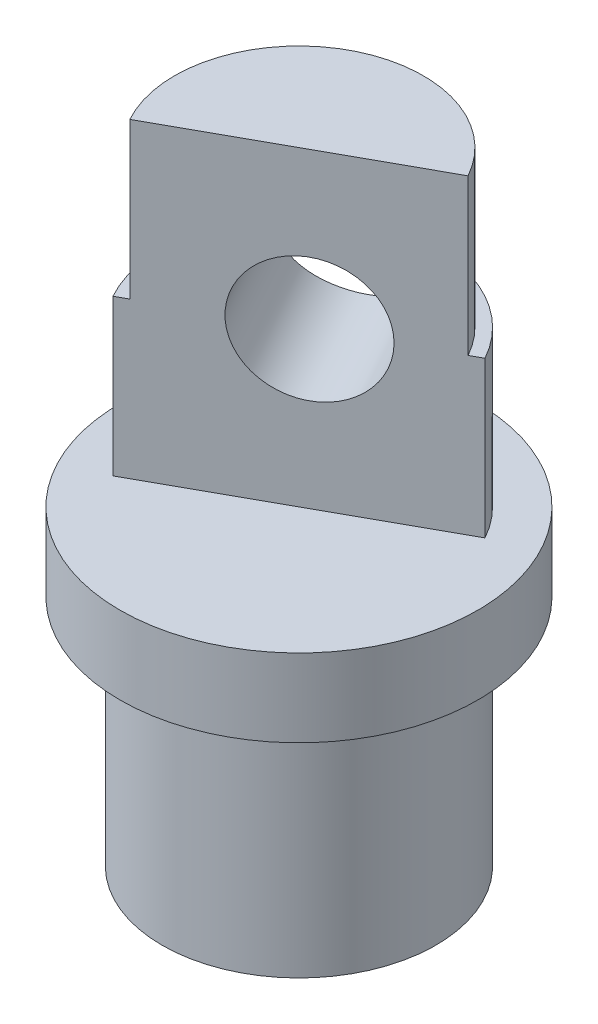
ISO-10303-21;
HEADER;
FILE_DESCRIPTION(('STEP AP214'),'2;1');
FILE_NAME('part.step','',(''),(''),'','','');
FILE_SCHEMA(('AUTOMOTIVE_DESIGN { 1 0 10303 214 1 1 1 1 }'));
ENDSEC;
DATA;
#1=APPLICATION_CONTEXT('core data for automotive mechanical design processes');
#2=APPLICATION_PROTOCOL_DEFINITION('international standard','automotive_design',2000,#1);
#3=PRODUCT_CONTEXT('',#1,'mechanical');
#4=PRODUCT('Part','Part','',(#3));
#5=PRODUCT_RELATED_PRODUCT_CATEGORY('part','',(#4));
#6=PRODUCT_DEFINITION_FORMATION('','',#4);
#7=PRODUCT_DEFINITION_CONTEXT('part definition',#1,'design');
#8=PRODUCT_DEFINITION('design','',#6,#7);
#9=PRODUCT_DEFINITION_SHAPE('','',#8);
#10=(LENGTH_UNIT() NAMED_UNIT(*) SI_UNIT(.MILLI.,.METRE.));
#11=(NAMED_UNIT(*) PLANE_ANGLE_UNIT() SI_UNIT($,.RADIAN.));
#12=(NAMED_UNIT(*) SI_UNIT($,.STERADIAN.) SOLID_ANGLE_UNIT());
#13=UNCERTAINTY_MEASURE_WITH_UNIT(LENGTH_MEASURE(1.E-05),#10,'distance_accuracy_value','');
#14=(GEOMETRIC_REPRESENTATION_CONTEXT(3) GLOBAL_UNCERTAINTY_ASSIGNED_CONTEXT((#13)) GLOBAL_UNIT_ASSIGNED_CONTEXT((#10,
#11,#12)) REPRESENTATION_CONTEXT('',''));
#15=CARTESIAN_POINT('',(0.,0.,0.));
#16=DIRECTION('',(0.,0.,1.));
#17=DIRECTION('',(1.,0.,0.));
#18=AXIS2_PLACEMENT_3D('',#15,#16,#17);
#19=CARTESIAN_POINT('',(0.,10.,0.));
#20=DIRECTION('',(0.,1.,0.));
#21=DIRECTION('',(0.,0.,1.));
#22=AXIS2_PLACEMENT_3D('',#19,#20,#21);
#23=PLANE('',#22);
#24=DIRECTION('',(0.482982259159725,0.,0.875630137293691));
#25=VECTOR('',#24,1.);
#26=CARTESIAN_POINT('',(-12.7243506637224,10.,-15.8221648388148));
#27=LINE('',#26,#25);
#28=CARTESIAN_POINT('',(-6.96431991364859,10.,-5.37942823545009));
#29=VERTEX_POINT('',#28);
#30=CARTESIAN_POINT('',(-6.53915779604642,10.,-4.60862401573455));
#31=VERTEX_POINT('',#30);
#32=EDGE_CURVE('E57',#29,#31,#27,.T.);
#33=ORIENTED_EDGE('',*,*,#32,.F.);
#34=CARTESIAN_POINT('',(0.,10.,0.));
#35=DIRECTION('',(0.,1.,0.));
#36=DIRECTION('',(0.,0.,1.));
#37=AXIS2_PLACEMENT_3D('',#34,#35,#36);
#38=CIRCLE('',#37,8.8);
#39=CARTESIAN_POINT('',(-7.70554520818448,10.,4.25024388060558));
#40=VERTEX_POINT('',#39);
#41=EDGE_CURVE('E64',#29,#40,#38,.T.);
#42=ORIENTED_EDGE('',*,*,#41,.T.);
#43=DIRECTION('',(-0.875630137293691,0.,0.482982259159725));
#44=VECTOR('',#43,1.);
#45=CARTESIAN_POINT('',(0.,10.,0.));
#46=LINE('',#45,#44);
#47=CARTESIAN_POINT('',(-7.00504109834953,10.,3.8638580732778));
#48=VERTEX_POINT('',#47);
#49=EDGE_CURVE('E129',#48,#40,#46,.T.);
#50=ORIENTED_EDGE('',*,*,#49,.F.);
#51=CARTESIAN_POINT('',(0.,10.,0.));
#52=DIRECTION('',(0.,1.,0.));
#53=DIRECTION('',(0.,0.,1.));
#54=AXIS2_PLACEMENT_3D('',#51,#52,#53);
#55=CIRCLE('',#54,8.);
#56=EDGE_CURVE('E120',#31,#48,#55,.T.);
#57=ORIENTED_EDGE('',*,*,#56,.F.);
#58=EDGE_LOOP('',(#33,#42,#50,#57));
#59=FACE_BOUND('',#58,.T.);
#60=ADVANCED_FACE('F35',(#59),#23,.T.);
#61=CARTESIAN_POINT('',(0.,10.,0.));
#62=DIRECTION('',(0.,-1.,0.));
#63=DIRECTION('',(0.,0.,-1.));
#64=AXIS2_PLACEMENT_3D('',#61,#62,#63);
#65=CYLINDRICAL_SURFACE('',#64,8.8);
#66=ORIENTED_EDGE('',*,*,#41,.F.);
#67=CARTESIAN_POINT('',(-6.96431991364859,10.,-5.37942823545009));
#68=CARTESIAN_POINT('',(-6.96432220289091,9.89210141958878,-5.37939929286805));
#69=CARTESIAN_POINT('',(-6.96141125486834,9.78421542854017,-5.38319325296465));
#70=CARTESIAN_POINT('',(-6.94978516830629,9.56931793282347,-5.39820804820861));
#71=CARTESIAN_POINT('',(-6.94107234337719,9.46230609678091,-5.40942592291577));
#72=CARTESIAN_POINT('',(-6.91791095127872,9.2503416928685,-5.43901093228729));
#73=CARTESIAN_POINT('',(-6.90348535642285,9.14538262296445,-5.45734942766403));
#74=CARTESIAN_POINT('',(-6.86894338621582,8.93784460777494,-5.5007620219522));
#75=CARTESIAN_POINT('',(-6.84882663585899,8.83526581981483,-5.52583656471456));
#76=CARTESIAN_POINT('',(-6.7800407087772,8.53236546186448,-5.61038103347538));
#77=CARTESIAN_POINT('',(-6.72288864384484,8.33644438682403,-5.67923550682383));
#78=CARTESIAN_POINT('',(-6.58627574413191,7.96118347706894,-5.83710693250562));
#79=CARTESIAN_POINT('',(-6.50679249003665,7.78186054777457,-5.92614412976562));
#80=CARTESIAN_POINT('',(-6.32100121200402,7.43465333851041,-6.12407382821569));
#81=CARTESIAN_POINT('',(-6.21351319905917,7.26784879592225,-6.23375806215649));
#82=CARTESIAN_POINT('',(-5.97442216281694,6.96051039071593,-6.46325857982505));
#83=CARTESIAN_POINT('',(-5.84281582483202,6.81998014445962,-6.58307625501586));
#84=CARTESIAN_POINT('',(-5.55231354350498,6.56538901360295,-6.83001630074398));
#85=CARTESIAN_POINT('',(-5.39274914151732,6.45219247878584,-6.95724947391196));
#86=CARTESIAN_POINT('',(-5.05148638067405,6.26165097800602,-7.20883483079804));
#87=CARTESIAN_POINT('',(-4.86980092234881,6.18428524155603,-7.33318864381032));
#88=CARTESIAN_POINT('',(-4.50083011390963,6.07225016941568,-7.56484741382379));
#89=CARTESIAN_POINT('',(-4.3146420036924,6.03517122900056,-7.67273393060156));
#90=CARTESIAN_POINT('',(-3.93192656901403,5.99651515684422,-7.87570994053218));
#91=CARTESIAN_POINT('',(-3.73540245203132,5.99492707594749,-7.97080337143408));
#92=CARTESIAN_POINT('',(-3.34904295499333,6.02597729779011,-8.14039652838706));
#93=CARTESIAN_POINT('',(-3.1594198666421,6.05677102499544,-8.2157313195642));
#94=CARTESIAN_POINT('',(-2.78194420993391,6.14814011708001,-8.35110884136956));
#95=CARTESIAN_POINT('',(-2.59409186880132,6.2087192524324,-8.41114963450109));
#96=CARTESIAN_POINT('',(-2.21847748853823,6.3600162079023,-8.51809213903458));
#97=CARTESIAN_POINT('',(-2.03096934497434,6.45175400409948,-8.56443386167103));
#98=CARTESIAN_POINT('',(-1.66818937084018,6.66182764931983,-8.64243176957126));
#99=CARTESIAN_POINT('',(-1.49292316714504,6.78017562534602,-8.67408123894737));
#100=CARTESIAN_POINT('',(-1.14349204802809,7.05292872389901,-8.72734296773273));
#101=CARTESIAN_POINT('',(-0.970966941324082,7.20967245661666,-8.74773788663034));
#102=CARTESIAN_POINT('',(-0.65149141205273,7.54869820873635,-8.77731928698406));
#103=CARTESIAN_POINT('',(-0.504561154393288,7.73100016194585,-8.78649696487438));
#104=CARTESIAN_POINT('',(-0.305680111343894,8.02454369510717,-8.79495412210706));
#105=CARTESIAN_POINT('',(-0.24198337661191,8.12791114346352,-8.79686999787534));
#106=CARTESIAN_POINT('',(-0.124174338627409,8.33996535139417,-8.79932074146859));
#107=CARTESIAN_POINT('',(-0.0700572667574645,8.44864942984181,-8.79985629820696));
#108=CARTESIAN_POINT('',(0.027571005021353,8.67042378208687,-8.80009242022067));
#109=CARTESIAN_POINT('',(0.0711037704673443,8.78350454264089,-8.79979469906223));
#110=CARTESIAN_POINT('',(0.14681611760782,9.01334976203387,-8.79885612823984));
#111=CARTESIAN_POINT('',(0.179001992347749,9.13011213975631,-8.79821546926913));
#112=CARTESIAN_POINT('',(0.232426570444255,9.37149042811306,-8.79697512100519));
#113=CARTESIAN_POINT('',(0.253126223489621,9.49622669556753,-8.79637843986787));
#114=CARTESIAN_POINT('',(0.280865537360464,9.74729628891789,-8.79551891583877));
#115=CARTESIAN_POINT('',(0.287895184386923,9.87363071739512,-8.79525631772414));
#116=CARTESIAN_POINT('',(0.287827188577564,10.,-8.79529166710892));
#117=B_SPLINE_CURVE_WITH_KNOTS('',3,(#67,#68,#69,#70,#71,#72,#73,#74,#75,#76,#77,#78,#79,#80,
#81,#82,#83,#84,#85,#86,#87,#88,#89,#90,#91,#92,#93,#94,#95,#96,#97,#98,#99,#100,#101,#102,#103,
#104,#105,#106,#107,#108,#109,#110,#111,#112,#113,#114,#115,#116),.UNSPECIFIED.,.F.,.F.,(4,2,2,
2,2,2,2,2,2,2,2,2,2,2,2,2,2,2,2,2,2,2,2,2,4),(0.,0.323568868536418,0.647008784949489,
0.969161073704104,1.29133459489305,1.93437029438007,2.57805388830937,3.25520985095699,
3.93245894801599,4.62892764324753,5.32499210086223,5.97663731976011,6.6280814991944,
7.24432891446323,7.8606543593083,8.49949055811039,9.13861848464775,9.83759192386127,
10.537113583044,10.9009944919438,11.2646937536915,11.6276456482034,11.9903959298336,
12.3689771446847,12.7478355803526),.UNSPECIFIED.);
#118=CARTESIAN_POINT('',(0.287827188577566,10.,-8.79529166710891));
#119=VERTEX_POINT('',#118);
#120=EDGE_CURVE('E155',#29,#119,#117,.T.);
#121=ORIENTED_EDGE('',*,*,#120,.T.);
#122=CARTESIAN_POINT('',(7.70554520818448,10.,-4.25024388060556));
#123=VERTEX_POINT('',#122);
#124=EDGE_CURVE('E112',#123,#119,#38,.T.);
#125=ORIENTED_EDGE('',*,*,#124,.F.);
#126=DIRECTION('',(0.,-1.,0.));
#127=VECTOR('',#126,1.);
#128=CARTESIAN_POINT('',(7.70554520818448,10.,-4.25024388060556));
#129=LINE('',#128,#127);
#130=CARTESIAN_POINT('',(7.70554520818448,0.,-4.25024388060556));
#131=VERTEX_POINT('',#130);
#132=EDGE_CURVE('E137',#123,#131,#129,.T.);
#133=ORIENTED_EDGE('',*,*,#132,.T.);
#134=CARTESIAN_POINT('',(0.,0.,0.));
#135=DIRECTION('',(0.,1.,0.));
#136=DIRECTION('',(0.,0.,1.));
#137=AXIS2_PLACEMENT_3D('',#134,#135,#136);
#138=CIRCLE('',#137,8.8);
#139=CARTESIAN_POINT('',(-7.70554520818448,0.,4.25024388060558));
#140=VERTEX_POINT('',#139);
#141=EDGE_CURVE('E123',#131,#140,#138,.T.);
#142=ORIENTED_EDGE('',*,*,#141,.T.);
#143=DIRECTION('',(0.,-1.,0.));
#144=VECTOR('',#143,1.);
#145=CARTESIAN_POINT('',(-7.70554520818448,10.,4.25024388060558));
#146=LINE('',#145,#144);
#147=EDGE_CURVE('E132',#40,#140,#146,.T.);
#148=ORIENTED_EDGE('',*,*,#147,.F.);
#149=EDGE_LOOP('',(#66,#121,#125,#133,#142,#148));
#150=FACE_BOUND('',#149,.T.);
#151=ADVANCED_FACE('F37',(#150),#65,.T.);
#152=CARTESIAN_POINT('',(0.,10.,0.));
#153=DIRECTION('',(0.482982259159725,0.,0.875630137293691));
#154=DIRECTION('',(0.875630137293691,0.,-0.482982259159725));
#155=AXIS2_PLACEMENT_3D('',#152,#153,#154);
#156=PLANE('',#155);
#157=CARTESIAN_POINT('',(0.437815068646844,10.,-0.241491129579862));
#158=DIRECTION('',(0.482982259159725,0.,0.875630137293691));
#159=DIRECTION('',(0.875630137293691,0.,-0.482982259159725));
#160=AXIS2_PLACEMENT_3D('',#157,#158,#159);
#161=CIRCLE('',#160,4.);
#162=CARTESIAN_POINT('',(3.94033561782161,10.,-2.17342016621876));
#163=VERTEX_POINT('',#162);
#164=EDGE_CURVE('E113',#163,#163,#161,.T.);
#165=ORIENTED_EDGE('',*,*,#164,.F.);
#166=EDGE_LOOP('',(#165));
#167=FACE_BOUND('',#166,.T.);
#168=ORIENTED_EDGE('',*,*,#147,.T.);
#169=DIRECTION('',(0.875630137293692,0.,-0.482982259159723));
#170=VECTOR('',#169,1.);
#171=CARTESIAN_POINT('',(0.,0.,0.));
#172=LINE('',#171,#170);
#173=EDGE_CURVE('E75',#140,#131,#172,.T.);
#174=ORIENTED_EDGE('',*,*,#173,.T.);
#175=ORIENTED_EDGE('',*,*,#132,.F.);
#176=DIRECTION('',(0.875630137293692,0.,-0.482982259159723));
#177=VECTOR('',#176,1.);
#178=CARTESIAN_POINT('',(0.,10.,0.));
#179=LINE('',#178,#177);
#180=CARTESIAN_POINT('',(7.00504109834953,10.,-3.8638580732778));
#181=VERTEX_POINT('',#180);
#182=EDGE_CURVE('E119',#181,#123,#179,.T.);
#183=ORIENTED_EDGE('',*,*,#182,.F.);
#184=DIRECTION('',(0.,-1.,0.));
#185=VECTOR('',#184,1.);
#186=CARTESIAN_POINT('',(7.00504109834953,20.,-3.8638580732778));
#187=LINE('',#186,#185);
#188=CARTESIAN_POINT('',(7.00504109834953,20.,-3.8638580732778));
#189=VERTEX_POINT('',#188);
#190=EDGE_CURVE('E117',#189,#181,#187,.T.);
#191=ORIENTED_EDGE('',*,*,#190,.F.);
#192=DIRECTION('',(0.875630137293691,0.,-0.482982259159725));
#193=VECTOR('',#192,1.);
#194=CARTESIAN_POINT('',(0.,20.,0.));
#195=LINE('',#194,#193);
#196=CARTESIAN_POINT('',(-7.00504109834953,20.,3.8638580732778));
#197=VERTEX_POINT('',#196);
#198=EDGE_CURVE('E142',#197,#189,#195,.T.);
#199=ORIENTED_EDGE('',*,*,#198,.F.);
#200=DIRECTION('',(0.,-1.,0.));
#201=VECTOR('',#200,1.);
#202=CARTESIAN_POINT('',(-7.00504109834953,20.,3.8638580732778));
#203=LINE('',#202,#201);
#204=EDGE_CURVE('E160',#197,#48,#203,.T.);
#205=ORIENTED_EDGE('',*,*,#204,.T.);
#206=ORIENTED_EDGE('',*,*,#49,.T.);
#207=EDGE_LOOP('',(#168,#174,#175,#183,#191,#199,#205,#206));
#208=FACE_BOUND('',#207,.T.);
#209=ADVANCED_FACE('F188',(#167,#208),#156,.T.);
#210=DIRECTION('',(0.482982259159725,0.,0.875630137293691));
#211=VECTOR('',#210,1.);
#212=CARTESIAN_POINT('',(-5.71930956537289,10.,-19.6860229120926));
#213=LINE('',#212,#211);
#214=CARTESIAN_POINT('',(0.745708254339659,10.,-7.96516912559989));
#215=VERTEX_POINT('',#214);
#216=EDGE_CURVE('E101',#215,#119,#213,.F.);
#217=ORIENTED_EDGE('',*,*,#216,.F.);
#218=EDGE_CURVE('E110',#181,#215,#55,.T.);
#219=ORIENTED_EDGE('',*,*,#218,.F.);
#220=ORIENTED_EDGE('',*,*,#182,.T.);
#221=ORIENTED_EDGE('',*,*,#124,.T.);
#222=EDGE_LOOP('',(#217,#219,#220,#221));
#223=FACE_BOUND('',#222,.T.);
#224=ADVANCED_FACE('F109',(#223),#23,.T.);
#225=CARTESIAN_POINT('',(0.,0.,0.));
#226=DIRECTION('',(0.,1.,0.));
#227=DIRECTION('',(0.,0.,1.));
#228=AXIS2_PLACEMENT_3D('',#225,#226,#227);
#229=PLANE('',#228);
#230=ORIENTED_EDGE('',*,*,#141,.F.);
#231=ORIENTED_EDGE('',*,*,#173,.F.);
#232=EDGE_LOOP('',(#230,#231));
#233=FACE_BOUND('',#232,.T.);
#234=CARTESIAN_POINT('',(0.,0.,0.));
#235=DIRECTION('',(0.,1.,0.));
#236=DIRECTION('',(0.,0.,1.));
#237=AXIS2_PLACEMENT_3D('',#234,#235,#236);
#238=CIRCLE('',#237,11.5);
#239=CARTESIAN_POINT('',(0.,0.,11.5));
#240=VERTEX_POINT('',#239);
#241=EDGE_CURVE('E125',#240,#240,#238,.T.);
#242=ORIENTED_EDGE('',*,*,#241,.T.);
#243=EDGE_LOOP('',(#242));
#244=FACE_BOUND('',#243,.T.);
#245=ADVANCED_FACE('F170',(#233,#244),#229,.T.);
#246=CARTESIAN_POINT('',(0.,-5.,0.));
#247=DIRECTION('',(0.,1.,0.));
#248=DIRECTION('',(0.,0.,1.));
#249=AXIS2_PLACEMENT_3D('',#246,#247,#248);
#250=CYLINDRICAL_SURFACE('',#249,11.5);
#251=CARTESIAN_POINT('',(0.,-5.,0.));
#252=DIRECTION('',(0.,1.,0.));
#253=DIRECTION('',(0.,0.,1.));
#254=AXIS2_PLACEMENT_3D('',#251,#252,#253);
#255=CIRCLE('',#254,11.5);
#256=CARTESIAN_POINT('',(0.,-5.,11.5));
#257=VERTEX_POINT('',#256);
#258=EDGE_CURVE('E135',#257,#257,#255,.T.);
#259=ORIENTED_EDGE('',*,*,#258,.T.);
#260=EDGE_LOOP('',(#259));
#261=FACE_BOUND('',#260,.T.);
#262=ORIENTED_EDGE('',*,*,#241,.F.);
#263=EDGE_LOOP('',(#262));
#264=FACE_BOUND('',#263,.T.);
#265=ADVANCED_FACE('F172',(#261,#264),#250,.T.);
#266=CARTESIAN_POINT('',(0.,-5.,0.));
#267=DIRECTION('',(0.,1.,0.));
#268=DIRECTION('',(0.,0.,1.));
#269=AXIS2_PLACEMENT_3D('',#266,#267,#268);
#270=PLANE('',#269);
#271=CARTESIAN_POINT('',(0.,-5.,0.));
#272=DIRECTION('',(0.,1.,0.));
#273=DIRECTION('',(0.,0.,1.));
#274=AXIS2_PLACEMENT_3D('',#271,#272,#273);
#275=CIRCLE('',#274,8.8);
#276=CARTESIAN_POINT('',(0.,-5.,8.8));
#277=VERTEX_POINT('',#276);
#278=EDGE_CURVE('E140',#277,#277,#275,.T.);
#279=ORIENTED_EDGE('',*,*,#278,.T.);
#280=EDGE_LOOP('',(#279));
#281=FACE_BOUND('',#280,.T.);
#282=ORIENTED_EDGE('',*,*,#258,.F.);
#283=EDGE_LOOP('',(#282));
#284=FACE_BOUND('',#283,.T.);
#285=ADVANCED_FACE('F174',(#281,#284),#270,.F.);
#286=CARTESIAN_POINT('',(0.,20.,0.));
#287=DIRECTION('',(0.,-1.,0.));
#288=DIRECTION('',(0.,0.,-1.));
#289=AXIS2_PLACEMENT_3D('',#286,#287,#288);
#290=CYLINDRICAL_SURFACE('',#289,8.);
#291=ORIENTED_EDGE('',*,*,#218,.T.);
#292=CARTESIAN_POINT('',(0.745708254339659,10.,-7.96516912559989));
#293=CARTESIAN_POINT('',(0.745743344645021,10.1022117724854,-7.96514874804964));
#294=CARTESIAN_POINT('',(0.740991602238525,10.2044031472943,-7.96561038014839));
#295=CARTESIAN_POINT('',(0.722185937965853,10.4078424855474,-7.96734638795599));
#296=CARTESIAN_POINT('',(0.708139233642986,10.5090911192205,-7.96862013303067));
#297=CARTESIAN_POINT('',(0.671143293148901,10.7092060550943,-7.97181838094412));
#298=CARTESIAN_POINT('',(0.648256570336927,10.8080840198916,-7.97373830226345));
#299=CARTESIAN_POINT('',(0.59405348537022,11.0034777716488,-7.97795959328334));
#300=CARTESIAN_POINT('',(0.562735845496108,11.0999931981414,-7.98026102078147));
#301=CARTESIAN_POINT('',(0.457142901403037,11.3845263163609,-7.98724050181386));
#302=CARTESIAN_POINT('',(0.371083158791604,11.5682795537561,-7.99201016065774));
#303=CARTESIAN_POINT('',(0.172223737692132,11.92091293406,-7.99876272436184));
#304=CARTESIAN_POINT('',(0.0593733693469037,12.0897640399714,-8.00074029649921));
#305=CARTESIAN_POINT('',(-0.201183821778084,12.426605278999,-7.99863621663031));
#306=CARTESIAN_POINT('',(-0.351273076838058,12.5927473731547,-7.99391531004346));
#307=CARTESIAN_POINT('',(-0.673292692183616,12.9017121440945,-7.97324677188734));
#308=CARTESIAN_POINT('',(-0.845230770753492,13.0445265392246,-7.95729516389074));
#309=CARTESIAN_POINT('',(-1.12539507065749,13.2460551870438,-7.92109051804056));
#310=CARTESIAN_POINT('',(-1.22785144216259,13.3138777087752,-7.90592566182195));
#311=CARTESIAN_POINT('',(-1.43709510329481,13.4409681867408,-7.87057775070424));
#312=CARTESIAN_POINT('',(-1.54388066070834,13.5002395220728,-7.85039668664768));
#313=CARTESIAN_POINT('',(-1.7609174220276,13.6096791982581,-7.80458046559721));
#314=CARTESIAN_POINT('',(-1.87116917501227,13.6598460882675,-7.77894444073672));
#315=CARTESIAN_POINT('',(-2.09409286242507,13.7504548929144,-7.7219167284521));
#316=CARTESIAN_POINT('',(-2.20676336529581,13.790902396114,-7.6905283669617));
#317=CARTESIAN_POINT('',(-2.42658375621865,13.8593765549445,-7.62391404833008));
#318=CARTESIAN_POINT('',(-2.53365077434009,13.8880107231227,-7.58903933513013));
#319=CARTESIAN_POINT('',(-2.74802079706246,13.9357962978158,-7.51407111998749));
#320=CARTESIAN_POINT('',(-2.85532365138363,13.9549525899073,-7.4739803202786));
#321=CARTESIAN_POINT('',(-3.06916668810956,13.9834591032184,-7.38873861777755));
#322=CARTESIAN_POINT('',(-3.17570719960339,13.9928138454111,-7.34359005852795));
#323=CARTESIAN_POINT('',(-3.38705724883727,14.001514681445,-7.24853531083326));
#324=CARTESIAN_POINT('',(-3.49186695430192,14.0008617508502,-7.19862958659553));
#325=CARTESIAN_POINT('',(-3.6875405620385,13.9900975716193,-7.10019078371985));
#326=CARTESIAN_POINT('',(-3.77868379692158,13.981020172547,-7.05209621225297));
#327=CARTESIAN_POINT('',(-3.95820303523616,13.9549069949435,-6.95292367875372));
#328=CARTESIAN_POINT('',(-4.04657814755713,13.9378686811775,-6.90184477086611));
#329=CARTESIAN_POINT('',(-4.2199160346781,13.8959809956468,-6.79724548894411));
#330=CARTESIAN_POINT('',(-4.30488028295133,13.8711350385939,-6.74372619095775));
#331=CARTESIAN_POINT('',(-4.47096114760795,13.8138587606899,-6.63478670113497));
#332=CARTESIAN_POINT('',(-4.55207627851332,13.7814255398871,-6.57936578940558));
#333=CARTESIAN_POINT('',(-4.7868024975255,13.6741500266802,-6.41271142337949));
#334=CARTESIAN_POINT('',(-4.93434316188111,13.5887043457754,-6.29952815694944));
#335=CARTESIAN_POINT('',(-5.21069492645494,13.3920229535217,-6.07294945556248));
#336=CARTESIAN_POINT('',(-5.33950041657858,13.280779543018,-5.95955396731072));
#337=CARTESIAN_POINT('',(-5.58693597543522,13.0256292779517,-5.72860869326914));
#338=CARTESIAN_POINT('',(-5.70398062396061,12.8798474031247,-5.61142838963874));
#339=CARTESIAN_POINT('',(-5.91517761648682,12.56479661413,-5.38835169314033));
#340=CARTESIAN_POINT('',(-6.00931343696434,12.3955108846634,-5.28246347569458));
#341=CARTESIAN_POINT('',(-6.18030563611945,12.0247410661199,-5.0815735163373));
#342=CARTESIAN_POINT('',(-6.25556972713823,11.8218558267753,-4.98778656177477));
#343=CARTESIAN_POINT('',(-6.37994019637686,11.3982243722165,-4.82770571241864));
#344=CARTESIAN_POINT('',(-6.42909057638727,11.177508928828,-4.76136561149924));
#345=CARTESIAN_POINT('',(-6.48975444725802,10.7963150211489,-4.67811843409398));
#346=CARTESIAN_POINT('',(-6.50825540874215,10.6388677321772,-4.65221249783627));
#347=CARTESIAN_POINT('',(-6.52678316417696,10.4005373771182,-4.62614393085576));
#348=CARTESIAN_POINT('',(-6.53142181094888,10.3206656950585,-4.61958601236739));
#349=CARTESIAN_POINT('',(-6.53760953227616,10.1605356219442,-4.61082133216896));
#350=CARTESIAN_POINT('',(-6.53915747017465,10.0802770994964,-4.60861617125746));
#351=CARTESIAN_POINT('',(-6.53915779604642,10.,-4.60862401573455));
#352=B_SPLINE_CURVE_WITH_KNOTS('',3,(#292,#293,#294,#295,#296,#297,#298,#299,#300,#301,#302,
#303,#304,#305,#306,#307,#308,#309,#310,#311,#312,#313,#314,#315,#316,#317,#318,#319,#320,#321,
#322,#323,#324,#325,#326,#327,#328,#329,#330,#331,#332,#333,#334,#335,#336,#337,#338,#339,#340,
#341,#342,#343,#344,#345,#346,#347,#348,#349,#350,#351),.UNSPECIFIED.,.F.,.F.,(4,2,2,2,2,2,2,2,
2,2,2,2,2,2,2,2,2,2,2,2,2,2,2,2,2,2,2,2,2,4),(0.,0.306490649867789,0.612743588402921,
0.916869339038788,1.22104120640599,1.82712592375454,2.4343666688239,3.10360601492298,
3.77308243622535,4.1440911159989,4.51495278356623,4.88587349819769,5.25658042358043,
5.6046570886326,5.95255414260064,6.30029065802506,6.64799327575395,6.95797249217577,
7.26805049200562,7.57799306597362,7.88805429817467,8.49913147302085,9.11039125487828,
9.76949237936931,10.4290674961406,11.1330983464433,11.8359391069002,12.3164491771816,
12.557110797672,12.7978609089739),.UNSPECIFIED.);
#353=EDGE_CURVE('E11',#215,#31,#352,.T.);
#354=ORIENTED_EDGE('',*,*,#353,.T.);
#355=ORIENTED_EDGE('',*,*,#56,.T.);
#356=ORIENTED_EDGE('',*,*,#204,.F.);
#357=CARTESIAN_POINT('',(0.,20.,0.));
#358=DIRECTION('',(0.,1.,0.));
#359=DIRECTION('',(0.,0.,1.));
#360=AXIS2_PLACEMENT_3D('',#357,#358,#359);
#361=CIRCLE('',#360,8.);
#362=EDGE_CURVE('E147',#189,#197,#361,.T.);
#363=ORIENTED_EDGE('',*,*,#362,.F.);
#364=ORIENTED_EDGE('',*,*,#190,.T.);
#365=EDGE_LOOP('',(#291,#354,#355,#356,#363,#364));
#366=FACE_BOUND('',#365,.T.);
#367=ADVANCED_FACE('F115',(#366),#290,.T.);
#368=CARTESIAN_POINT('',(0.,20.,0.));
#369=DIRECTION('',(0.,1.,0.));
#370=DIRECTION('',(0.,0.,1.));
#371=AXIS2_PLACEMENT_3D('',#368,#369,#370);
#372=PLANE('',#371);
#373=ORIENTED_EDGE('',*,*,#198,.T.);
#374=ORIENTED_EDGE('',*,*,#362,.T.);
#375=EDGE_LOOP('',(#373,#374));
#376=FACE_BOUND('',#375,.T.);
#377=ADVANCED_FACE('F202',(#376),#372,.T.);
#378=CARTESIAN_POINT('',(0.,-20.,0.));
#379=DIRECTION('',(0.,1.,0.));
#380=DIRECTION('',(0.,0.,1.));
#381=AXIS2_PLACEMENT_3D('',#378,#379,#380);
#382=CYLINDRICAL_SURFACE('',#381,8.8);
#383=CARTESIAN_POINT('',(0.,-20.,0.));
#384=DIRECTION('',(0.,1.,0.));
#385=DIRECTION('',(0.,0.,1.));
#386=AXIS2_PLACEMENT_3D('',#383,#384,#385);
#387=CIRCLE('',#386,8.8);
#388=CARTESIAN_POINT('',(0.,-20.,8.8));
#389=VERTEX_POINT('',#388);
#390=EDGE_CURVE('E150',#389,#389,#387,.T.);
#391=ORIENTED_EDGE('',*,*,#390,.T.);
#392=EDGE_LOOP('',(#391));
#393=FACE_BOUND('',#392,.T.);
#394=ORIENTED_EDGE('',*,*,#278,.F.);
#395=EDGE_LOOP('',(#394));
#396=FACE_BOUND('',#395,.T.);
#397=ADVANCED_FACE('F220',(#393,#396),#382,.T.);
#398=CARTESIAN_POINT('',(0.,-20.,0.));
#399=DIRECTION('',(0.,1.,0.));
#400=DIRECTION('',(0.,0.,1.));
#401=AXIS2_PLACEMENT_3D('',#398,#399,#400);
#402=CYLINDRICAL_SURFACE('',#401,8.);
#403=CARTESIAN_POINT('',(0.,-20.,0.));
#404=DIRECTION('',(0.,1.,0.));
#405=DIRECTION('',(0.,0.,1.));
#406=AXIS2_PLACEMENT_3D('',#403,#404,#405);
#407=CIRCLE('',#406,8.);
#408=CARTESIAN_POINT('',(0.,-20.,8.));
#409=VERTEX_POINT('',#408);
#410=EDGE_CURVE('E143',#409,#409,#407,.T.);
#411=ORIENTED_EDGE('',*,*,#410,.F.);
#412=EDGE_LOOP('',(#411));
#413=FACE_BOUND('',#412,.T.);
#414=CARTESIAN_POINT('',(0.,-5.,0.));
#415=DIRECTION('',(0.,1.,0.));
#416=DIRECTION('',(0.,0.,1.));
#417=AXIS2_PLACEMENT_3D('',#414,#415,#416);
#418=CIRCLE('',#417,8.);
#419=CARTESIAN_POINT('',(0.,-5.,8.));
#420=VERTEX_POINT('',#419);
#421=EDGE_CURVE('E50',#420,#420,#418,.T.);
#422=ORIENTED_EDGE('',*,*,#421,.T.);
#423=EDGE_LOOP('',(#422));
#424=FACE_BOUND('',#423,.T.);
#425=ADVANCED_FACE('F216',(#413,#424),#402,.F.);
#426=CARTESIAN_POINT('',(0.,-20.,0.));
#427=DIRECTION('',(0.,1.,0.));
#428=DIRECTION('',(0.,0.,1.));
#429=AXIS2_PLACEMENT_3D('',#426,#427,#428);
#430=PLANE('',#429);
#431=ORIENTED_EDGE('',*,*,#390,.F.);
#432=EDGE_LOOP('',(#431));
#433=FACE_BOUND('',#432,.T.);
#434=ORIENTED_EDGE('',*,*,#410,.T.);
#435=EDGE_LOOP('',(#434));
#436=FACE_BOUND('',#435,.T.);
#437=ADVANCED_FACE('F212',(#433,#436),#430,.F.);
#438=ORIENTED_EDGE('',*,*,#421,.F.);
#439=EDGE_LOOP('',(#438));
#440=FACE_BOUND('',#439,.T.);
#441=ADVANCED_FACE('F181',(#440),#270,.F.);
#442=CARTESIAN_POINT('',(-9.22183011454765,10.,-17.7540938754537));
#443=DIRECTION('',(0.482982259159725,0.,0.875630137293691));
#444=DIRECTION('',(0.875630137293691,0.,-0.482982259159725));
#445=AXIS2_PLACEMENT_3D('',#442,#443,#444);
#446=CYLINDRICAL_SURFACE('',#445,4.);
#447=ORIENTED_EDGE('',*,*,#164,.T.);
#448=EDGE_LOOP('',(#447));
#449=FACE_BOUND('',#448,.T.);
#450=ORIENTED_EDGE('',*,*,#32,.T.);
#451=ORIENTED_EDGE('',*,*,#353,.F.);
#452=ORIENTED_EDGE('',*,*,#216,.T.);
#453=ORIENTED_EDGE('',*,*,#120,.F.);
#454=EDGE_LOOP('',(#450,#451,#452,#453));
#455=FACE_BOUND('',#454,.T.);
#456=ADVANCED_FACE('F100',(#449,#455),#446,.F.);
#457=CLOSED_SHELL('',(#60,#151,#209,#224,#245,#265,#285,#367,#377,#397,#425,#437,#441,#456));
#458=MANIFOLD_SOLID_BREP('B2',#457);
#459=ADVANCED_BREP_SHAPE_REPRESENTATION('',(#18,#458),#14);
#460=SHAPE_DEFINITION_REPRESENTATION(#9,#459);
ENDSEC;
END-ISO-10303-21;
